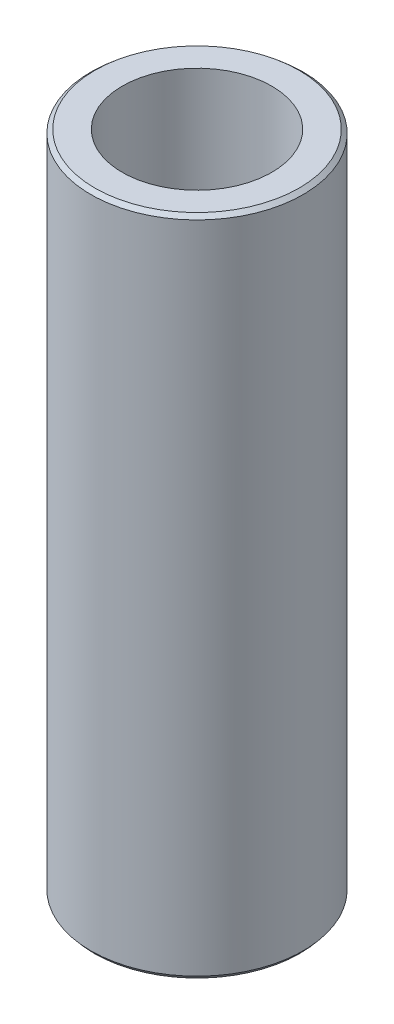
ISO-10303-21;
HEADER;
FILE_DESCRIPTION(('STEP AP214'),'2;1');
FILE_NAME('part.step','',(''),(''),'','','');
FILE_SCHEMA(('AUTOMOTIVE_DESIGN { 1 0 10303 214 1 1 1 1 }'));
ENDSEC;
DATA;
#1=APPLICATION_CONTEXT('core data for automotive mechanical design processes');
#2=APPLICATION_PROTOCOL_DEFINITION('international standard','automotive_design',2000,#1);
#3=PRODUCT_CONTEXT('',#1,'mechanical');
#4=PRODUCT('Part','Part','',(#3));
#5=PRODUCT_RELATED_PRODUCT_CATEGORY('part','',(#4));
#6=PRODUCT_DEFINITION_FORMATION('','',#4);
#7=PRODUCT_DEFINITION_CONTEXT('part definition',#1,'design');
#8=PRODUCT_DEFINITION('design','',#6,#7);
#9=PRODUCT_DEFINITION_SHAPE('','',#8);
#10=(LENGTH_UNIT() NAMED_UNIT(*) SI_UNIT(.MILLI.,.METRE.));
#11=(NAMED_UNIT(*) PLANE_ANGLE_UNIT() SI_UNIT($,.RADIAN.));
#12=(NAMED_UNIT(*) SI_UNIT($,.STERADIAN.) SOLID_ANGLE_UNIT());
#13=UNCERTAINTY_MEASURE_WITH_UNIT(LENGTH_MEASURE(1.E-05),#10,'distance_accuracy_value','');
#14=(GEOMETRIC_REPRESENTATION_CONTEXT(3) GLOBAL_UNCERTAINTY_ASSIGNED_CONTEXT((#13)) GLOBAL_UNIT_ASSIGNED_CONTEXT((#10,
#11,#12)) REPRESENTATION_CONTEXT('',''));
#15=CARTESIAN_POINT('',(0.,0.,0.));
#16=DIRECTION('',(0.,0.,1.));
#17=DIRECTION('',(1.,0.,0.));
#18=AXIS2_PLACEMENT_3D('',#15,#16,#17);
#19=CARTESIAN_POINT('',(0.,249.563489130489,0.));
#20=DIRECTION('',(0.,-1.,0.));
#21=DIRECTION('',(0.,0.,-1.));
#22=AXIS2_PLACEMENT_3D('',#19,#20,#21);
#23=CYLINDRICAL_SURFACE('',#22,40.);
#24=CARTESIAN_POINT('',(0.,248.243551360814,0.));
#25=DIRECTION('',(0.,1.,0.));
#26=DIRECTION('',(0.,0.,1.));
#27=AXIS2_PLACEMENT_3D('',#24,#25,#26);
#28=CIRCLE('',#27,40.);
#29=CARTESIAN_POINT('',(0.,248.243551360814,-40.));
#30=VERTEX_POINT('',#29);
#31=EDGE_CURVE('E50',#30,#30,#28,.F.);
#32=CARTESIAN_POINT('',(0.,1.55351664917483,0.));
#33=DIRECTION('',(0.,1.,0.));
#34=DIRECTION('',(0.,0.,1.));
#35=AXIS2_PLACEMENT_3D('',#32,#33,#34);
#36=CIRCLE('',#35,40.);
#37=CARTESIAN_POINT('',(0.,1.5535166491748,-40.));
#38=VERTEX_POINT('',#37);
#39=EDGE_CURVE('E51',#38,#38,#36,.T.);
#40=CARTESIAN_POINT('',(0.,248.243551360814,-40.));
#41=CARTESIAN_POINT('',(0.,245.673863499235,-40.));
#42=CARTESIAN_POINT('',(0.,243.104175637655,-40.));
#43=CARTESIAN_POINT('',(0.,237.964799914496,-40.));
#44=CARTESIAN_POINT('',(0.,235.395112052916,-40.));
#45=CARTESIAN_POINT('',(0.,230.255736329757,-40.));
#46=CARTESIAN_POINT('',(0.,227.686048468178,-40.));
#47=CARTESIAN_POINT('',(0.,222.546672745018,-40.));
#48=CARTESIAN_POINT('',(0.,219.976984883439,-40.));
#49=CARTESIAN_POINT('',(0.,214.83760916028,-40.));
#50=CARTESIAN_POINT('',(0.,212.2679212987,-40.));
#51=CARTESIAN_POINT('',(0.,207.128545575541,-40.));
#52=CARTESIAN_POINT('',(0.,204.558857713961,-40.));
#53=CARTESIAN_POINT('',(0.,199.419481990802,-40.));
#54=CARTESIAN_POINT('',(0.,196.849794129223,-40.));
#55=CARTESIAN_POINT('',(0.,191.710418406064,-40.));
#56=CARTESIAN_POINT('',(0.,189.140730544484,-40.));
#57=CARTESIAN_POINT('',(0.,184.001354821325,-40.));
#58=CARTESIAN_POINT('',(0.,181.431666959745,-40.));
#59=CARTESIAN_POINT('',(0.,176.292291236586,-40.));
#60=CARTESIAN_POINT('',(0.,173.722603375007,-40.));
#61=CARTESIAN_POINT('',(0.,168.583227651847,-40.));
#62=CARTESIAN_POINT('',(0.,166.013539790268,-40.));
#63=CARTESIAN_POINT('',(0.,160.874164067109,-40.));
#64=CARTESIAN_POINT('',(0.,158.304476205529,-40.));
#65=CARTESIAN_POINT('',(0.,153.16510048237,-40.));
#66=CARTESIAN_POINT('',(0.,150.59541262079,-40.));
#67=CARTESIAN_POINT('',(0.,145.456036897631,-40.));
#68=CARTESIAN_POINT('',(0.,142.886349036052,-40.));
#69=CARTESIAN_POINT('',(0.,137.746973312892,-40.));
#70=CARTESIAN_POINT('',(0.,135.177285451313,-40.));
#71=CARTESIAN_POINT('',(0.,130.037909728154,-40.));
#72=CARTESIAN_POINT('',(0.,127.468221866574,-40.));
#73=CARTESIAN_POINT('',(0.,122.328846143415,-40.));
#74=CARTESIAN_POINT('',(0.,119.759158281835,-40.));
#75=CARTESIAN_POINT('',(0.,114.619782558676,-40.));
#76=CARTESIAN_POINT('',(0.,112.050094697097,-40.));
#77=CARTESIAN_POINT('',(0.,106.910718973937,-40.));
#78=CARTESIAN_POINT('',(0.,104.341031112358,-40.));
#79=CARTESIAN_POINT('',(0.,99.2016553891988,-40.));
#80=CARTESIAN_POINT('',(0.,96.6319675276192,-40.));
#81=CARTESIAN_POINT('',(0.,91.49259180446,-40.));
#82=CARTESIAN_POINT('',(0.,88.9229039428805,-40.));
#83=CARTESIAN_POINT('',(0.,83.7835282197213,-40.));
#84=CARTESIAN_POINT('',(0.,81.2138403581417,-40.));
#85=CARTESIAN_POINT('',(0.,76.0744646349826,-40.));
#86=CARTESIAN_POINT('',(0.,73.504776773403,-40.));
#87=CARTESIAN_POINT('',(0.,68.3654010502438,-40.));
#88=CARTESIAN_POINT('',(0.,65.7957131886642,-40.));
#89=CARTESIAN_POINT('',(0.,60.6563374655051,-40.));
#90=CARTESIAN_POINT('',(0.,58.0866496039255,-40.));
#91=CARTESIAN_POINT('',(0.,52.9472738807664,-40.));
#92=CARTESIAN_POINT('',(0.,50.3775860191868,-40.));
#93=CARTESIAN_POINT('',(0.,45.2382102960276,-40.));
#94=CARTESIAN_POINT('',(0.,42.6685224344481,-40.));
#95=CARTESIAN_POINT('',(0.,37.5291467112889,-40.));
#96=CARTESIAN_POINT('',(0.,34.9594588497093,-40.));
#97=CARTESIAN_POINT('',(0.,29.8200831265502,-40.));
#98=CARTESIAN_POINT('',(0.,27.2503952649706,-40.));
#99=CARTESIAN_POINT('',(0.,22.1110195418114,-40.));
#100=CARTESIAN_POINT('',(0.,19.5413316802318,-40.));
#101=CARTESIAN_POINT('',(0.,14.4019559570727,-40.));
#102=CARTESIAN_POINT('',(0.,11.8322680954931,-40.));
#103=CARTESIAN_POINT('',(0.,6.69289237233397,-40.));
#104=CARTESIAN_POINT('',(0.,4.12320451075438,-40.));
#105=CARTESIAN_POINT('',(0.,1.5535166491748,-40.));
#106=B_SPLINE_CURVE_WITH_KNOTS('',3,(#40,#41,#42,#43,#44,#45,#46,#47,#48,#49,#50,#51,#52,#53,
#54,#55,#56,#57,#58,#59,#60,#61,#62,#63,#64,#65,#66,#67,#68,#69,#70,#71,#72,#73,#74,#75,#76,#77,
#78,#79,#80,#81,#82,#83,#84,#85,#86,#87,#88,#89,#90,#91,#92,#93,#94,#95,#96,#97,#98,#99,#100,
#101,#102,#103,#104,#105),.UNSPECIFIED.,.F.,.F.,(4,2,2,2,2,2,2,2,2,2,2,2,2,2,2,2,2,2,2,2,2,2,2,
2,2,2,2,2,2,2,2,2,4),(0.,7.70906358473872,15.4181271694775,23.1271907542162,30.8362543389549,
38.5453179236936,46.2543815084324,53.9634450931711,61.6725086779098,69.3815722626486,
77.0906358473873,84.799699432126,92.5087630168648,100.217826601604,107.926890186342,
115.635953771081,123.34501735582,131.054080940558,138.763144525297,146.472208110036,
154.181271694775,161.890335279513,169.599398864252,177.308462448991,185.01752603373,
192.726589618468,200.435653203207,208.144716787946,215.853780372685,223.562843957423,
231.271907542162,238.980971126901,246.690034711639),.UNSPECIFIED.);
#107=EDGE_CURVE('BSEAM39',#30,#38,#106,.T.);
#108=ORIENTED_EDGE('',*,*,#31,.T.);
#109=ORIENTED_EDGE('',*,*,#39,.T.);
#110=ORIENTED_EDGE('',*,*,#107,.T.);
#111=ORIENTED_EDGE('',*,*,#107,.F.);
#112=EDGE_LOOP('',(#108,#110,#109,#111));
#113=FACE_BOUND('',#112,.T.);
#114=ADVANCED_FACE('F39',(#113),#23,.T.);
#115=CARTESIAN_POINT('',(0.,249.563489130489,0.));
#116=DIRECTION('',(0.,1.,0.));
#117=DIRECTION('',(0.,0.,1.));
#118=AXIS2_PLACEMENT_3D('',#115,#116,#117);
#119=PLANE('',#118);
#120=CARTESIAN_POINT('',(0.,249.563489130489,0.));
#121=DIRECTION('',(0.,1.,0.));
#122=DIRECTION('',(0.,0.,1.));
#123=AXIS2_PLACEMENT_3D('',#120,#121,#122);
#124=CIRCLE('',#123,38.4464833508255);
#125=CARTESIAN_POINT('',(0.,249.563489130489,38.4464833508255));
#126=VERTEX_POINT('',#125);
#127=EDGE_CURVE('E54',#126,#126,#124,.T.);
#128=ORIENTED_EDGE('',*,*,#127,.T.);
#129=EDGE_LOOP('',(#128));
#130=FACE_BOUND('',#129,.T.);
#131=CARTESIAN_POINT('',(0.,249.563489130489,0.));
#132=DIRECTION('',(0.,1.,0.));
#133=DIRECTION('',(0.,0.,1.));
#134=AXIS2_PLACEMENT_3D('',#131,#132,#133);
#135=CIRCLE('',#134,28.1653913730367);
#136=CARTESIAN_POINT('',(0.,249.563489130489,-28.1653913730367));
#137=VERTEX_POINT('',#136);
#138=EDGE_CURVE('E58',#137,#137,#135,.T.);
#139=ORIENTED_EDGE('',*,*,#138,.F.);
#140=EDGE_LOOP('',(#139));
#141=FACE_BOUND('',#140,.T.);
#142=ADVANCED_FACE('F69',(#130,#141),#119,.T.);
#143=CARTESIAN_POINT('',(0.,0.,0.));
#144=DIRECTION('',(0.,1.,0.));
#145=DIRECTION('',(0.,0.,1.));
#146=AXIS2_PLACEMENT_3D('',#143,#144,#145);
#147=PLANE('',#146);
#148=CARTESIAN_POINT('',(0.,0.,0.));
#149=DIRECTION('',(0.,1.,0.));
#150=DIRECTION('',(0.,0.,1.));
#151=AXIS2_PLACEMENT_3D('',#148,#149,#150);
#152=CIRCLE('',#151,38.6800622303252);
#153=CARTESIAN_POINT('',(0.,0.,38.6800622303252));
#154=VERTEX_POINT('',#153);
#155=EDGE_CURVE('E10',#154,#154,#152,.F.);
#156=ORIENTED_EDGE('',*,*,#155,.T.);
#157=EDGE_LOOP('',(#156));
#158=FACE_BOUND('',#157,.T.);
#159=CARTESIAN_POINT('',(0.,0.,0.));
#160=DIRECTION('',(0.,1.,0.));
#161=DIRECTION('',(0.,0.,1.));
#162=AXIS2_PLACEMENT_3D('',#159,#160,#161);
#163=CIRCLE('',#162,28.1653913730367);
#164=CARTESIAN_POINT('',(0.,0.,-28.1653913730367));
#165=VERTEX_POINT('',#164);
#166=EDGE_CURVE('E63',#165,#165,#163,.T.);
#167=ORIENTED_EDGE('',*,*,#166,.T.);
#168=EDGE_LOOP('',(#167));
#169=FACE_BOUND('',#168,.T.);
#170=ADVANCED_FACE('F75',(#158,#169),#147,.F.);
#171=CARTESIAN_POINT('',(0.,249.563489130489,0.));
#172=DIRECTION('',(0.,-1.,0.));
#173=DIRECTION('',(0.,0.,-1.));
#174=AXIS2_PLACEMENT_3D('',#171,#172,#173);
#175=CYLINDRICAL_SURFACE('',#174,28.1653913730367);
#176=CARTESIAN_POINT('',(0.,249.563489130489,-28.1653913730367));
#177=CARTESIAN_POINT('',(0.,246.963869452046,-28.1653913730367));
#178=CARTESIAN_POINT('',(0.,244.364249773604,-28.1653913730367));
#179=CARTESIAN_POINT('',(0.,239.165010416718,-28.1653913730367));
#180=CARTESIAN_POINT('',(0.,236.565390738276,-28.1653913730367));
#181=CARTESIAN_POINT('',(0.,231.366151381391,-28.1653913730367));
#182=CARTESIAN_POINT('',(0.,228.766531702948,-28.1653913730367));
#183=CARTESIAN_POINT('',(0.,223.567292346063,-28.1653913730367));
#184=CARTESIAN_POINT('',(0.,220.96767266762,-28.1653913730367));
#185=CARTESIAN_POINT('',(0.,215.768433310735,-28.1653913730367));
#186=CARTESIAN_POINT('',(0.,213.168813632292,-28.1653913730367));
#187=CARTESIAN_POINT('',(0.,207.969574275407,-28.1653913730367));
#188=CARTESIAN_POINT('',(0.,205.369954596965,-28.1653913730367));
#189=CARTESIAN_POINT('',(0.,200.17071524008,-28.1653913730367));
#190=CARTESIAN_POINT('',(0.,197.571095561637,-28.1653913730367));
#191=CARTESIAN_POINT('',(0.,192.371856204752,-28.1653913730367));
#192=CARTESIAN_POINT('',(0.,189.772236526309,-28.1653913730367));
#193=CARTESIAN_POINT('',(0.,184.572997169424,-28.1653913730367));
#194=CARTESIAN_POINT('',(0.,181.973377490981,-28.1653913730367));
#195=CARTESIAN_POINT('',(0.,176.774138134096,-28.1653913730367));
#196=CARTESIAN_POINT('',(0.,174.174518455654,-28.1653913730367));
#197=CARTESIAN_POINT('',(0.,168.975279098768,-28.1653913730367));
#198=CARTESIAN_POINT('',(0.,166.375659420326,-28.1653913730367));
#199=CARTESIAN_POINT('',(0.,161.176420063441,-28.1653913730367));
#200=CARTESIAN_POINT('',(0.,158.576800384998,-28.1653913730367));
#201=CARTESIAN_POINT('',(0.,153.377561028113,-28.1653913730367));
#202=CARTESIAN_POINT('',(0.,150.77794134967,-28.1653913730367));
#203=CARTESIAN_POINT('',(0.,145.578701992785,-28.1653913730367));
#204=CARTESIAN_POINT('',(0.,142.979082314343,-28.1653913730367));
#205=CARTESIAN_POINT('',(0.,137.779842957457,-28.1653913730367));
#206=CARTESIAN_POINT('',(0.,135.180223279015,-28.1653913730367));
#207=CARTESIAN_POINT('',(0.,129.98098392213,-28.1653913730367));
#208=CARTESIAN_POINT('',(0.,127.381364243687,-28.1653913730367));
#209=CARTESIAN_POINT('',(0.,122.182124886802,-28.1653913730367));
#210=CARTESIAN_POINT('',(0.,119.582505208359,-28.1653913730367));
#211=CARTESIAN_POINT('',(0.,114.383265851474,-28.1653913730367));
#212=CARTESIAN_POINT('',(0.,111.783646173031,-28.1653913730367));
#213=CARTESIAN_POINT('',(0.,106.584406816146,-28.1653913730367));
#214=CARTESIAN_POINT('',(0.,103.984787137704,-28.1653913730367));
#215=CARTESIAN_POINT('',(0.,98.7855477808185,-28.1653913730367));
#216=CARTESIAN_POINT('',(0.,96.1859281023759,-28.1653913730367));
#217=CARTESIAN_POINT('',(0.,90.9866887454907,-28.1653913730367));
#218=CARTESIAN_POINT('',(0.,88.3870690670481,-28.1653913730367));
#219=CARTESIAN_POINT('',(0.,83.1878297101629,-28.1653913730367));
#220=CARTESIAN_POINT('',(0.,80.5882100317203,-28.1653913730367));
#221=CARTESIAN_POINT('',(0.,75.3889706748352,-28.1653913730367));
#222=CARTESIAN_POINT('',(0.,72.7893509963926,-28.1653913730367));
#223=CARTESIAN_POINT('',(0.,67.5901116395074,-28.1653913730367));
#224=CARTESIAN_POINT('',(0.,64.9904919610648,-28.1653913730367));
#225=CARTESIAN_POINT('',(0.,59.7912526041796,-28.1653913730367));
#226=CARTESIAN_POINT('',(0.,57.191632925737,-28.1653913730367));
#227=CARTESIAN_POINT('',(0.,51.9923935688518,-28.1653913730367));
#228=CARTESIAN_POINT('',(0.,49.3927738904092,-28.1653913730367));
#229=CARTESIAN_POINT('',(0.,44.1935345335241,-28.1653913730367));
#230=CARTESIAN_POINT('',(0.,41.5939148550815,-28.1653913730367));
#231=CARTESIAN_POINT('',(0.,36.3946754981963,-28.1653913730367));
#232=CARTESIAN_POINT('',(0.,33.7950558197537,-28.1653913730367));
#233=CARTESIAN_POINT('',(0.,28.5958164628685,-28.1653913730367));
#234=CARTESIAN_POINT('',(0.,25.9961967844259,-28.1653913730367));
#235=CARTESIAN_POINT('',(0.,20.7969574275407,-28.1653913730367));
#236=CARTESIAN_POINT('',(0.,18.1973377490981,-28.1653913730367));
#237=CARTESIAN_POINT('',(0.,12.998098392213,-28.1653913730367));
#238=CARTESIAN_POINT('',(0.,10.3984787137704,-28.1653913730367));
#239=CARTESIAN_POINT('',(0.,5.19923935688519,-28.1653913730367));
#240=CARTESIAN_POINT('',(0.,2.5996196784426,-28.1653913730367));
#241=CARTESIAN_POINT('',(0.,0.,-28.1653913730367));
#242=B_SPLINE_CURVE_WITH_KNOTS('',3,(#176,#177,#178,#179,#180,#181,#182,#183,#184,#185,#186,
#187,#188,#189,#190,#191,#192,#193,#194,#195,#196,#197,#198,#199,#200,#201,#202,#203,#204,#205,
#206,#207,#208,#209,#210,#211,#212,#213,#214,#215,#216,#217,#218,#219,#220,#221,#222,#223,#224,
#225,#226,#227,#228,#229,#230,#231,#232,#233,#234,#235,#236,#237,#238,#239,#240,#241),
.UNSPECIFIED.,.F.,.F.,(4,2,2,2,2,2,2,2,2,2,2,2,2,2,2,2,2,2,2,2,2,2,2,2,2,2,2,2,2,2,2,2,4),(0.,
7.79885903532776,15.5977180706555,23.3965771059833,31.1954361413111,38.9942951766389,
46.7931542119666,54.5920132472944,62.3908722826222,70.1897313179499,77.9885903532777,
85.7874493886055,93.5863084239333,101.385167459261,109.184026494589,116.982885529917,
124.781744565244,132.580603600572,140.3794626359,148.178321671228,155.977180706555,
163.776039741883,171.574898777211,179.373757812539,187.172616847867,194.971475883194,
202.770334918522,210.56919395385,218.368052989178,226.166912024505,233.965771059833,
241.764630095161,249.563489130489),.UNSPECIFIED.);
#243=EDGE_CURVE('BSEAM70',#137,#165,#242,.T.);
#244=ORIENTED_EDGE('',*,*,#138,.T.);
#245=ORIENTED_EDGE('',*,*,#166,.F.);
#246=ORIENTED_EDGE('',*,*,#243,.T.);
#247=ORIENTED_EDGE('',*,*,#243,.F.);
#248=EDGE_LOOP('',(#244,#246,#245,#247));
#249=FACE_BOUND('',#248,.T.);
#250=ADVANCED_FACE('F70',(#249),#175,.F.);
#251=CARTESIAN_POINT('',(0.,249.563489130489,0.));
#252=DIRECTION('',(0.,-1.,0.));
#253=DIRECTION('',(0.,0.,-1.));
#254=AXIS2_PLACEMENT_3D('',#251,#252,#253);
#255=CONICAL_SURFACE('',#254,38.4464833508255,0.866508350979516);
#256=ORIENTED_EDGE('',*,*,#31,.F.);
#257=EDGE_LOOP('',(#256));
#258=FACE_BOUND('',#257,.T.);
#259=ORIENTED_EDGE('',*,*,#127,.F.);
#260=EDGE_LOOP('',(#259));
#261=FACE_BOUND('',#260,.T.);
#262=ADVANCED_FACE('F81',(#258,#261),#255,.T.);
#263=CARTESIAN_POINT('',(0.,1.55351664917483,0.));
#264=DIRECTION('',(0.,1.,0.));
#265=DIRECTION('',(0.,0.,1.));
#266=AXIS2_PLACEMENT_3D('',#263,#264,#265);
#267=CONICAL_SURFACE('',#266,40.,0.704287975815376);
#268=ORIENTED_EDGE('',*,*,#155,.F.);
#269=EDGE_LOOP('',(#268));
#270=FACE_BOUND('',#269,.T.);
#271=ORIENTED_EDGE('',*,*,#39,.F.);
#272=EDGE_LOOP('',(#271));
#273=FACE_BOUND('',#272,.T.);
#274=ADVANCED_FACE('F45',(#270,#273),#267,.T.);
#275=CLOSED_SHELL('',(#114,#142,#170,#250,#262,#274));
#276=MANIFOLD_SOLID_BREP('B2',#275);
#277=ADVANCED_BREP_SHAPE_REPRESENTATION('',(#18,#276),#14);
#278=SHAPE_DEFINITION_REPRESENTATION(#9,#277);
ENDSEC;
END-ISO-10303-21;
